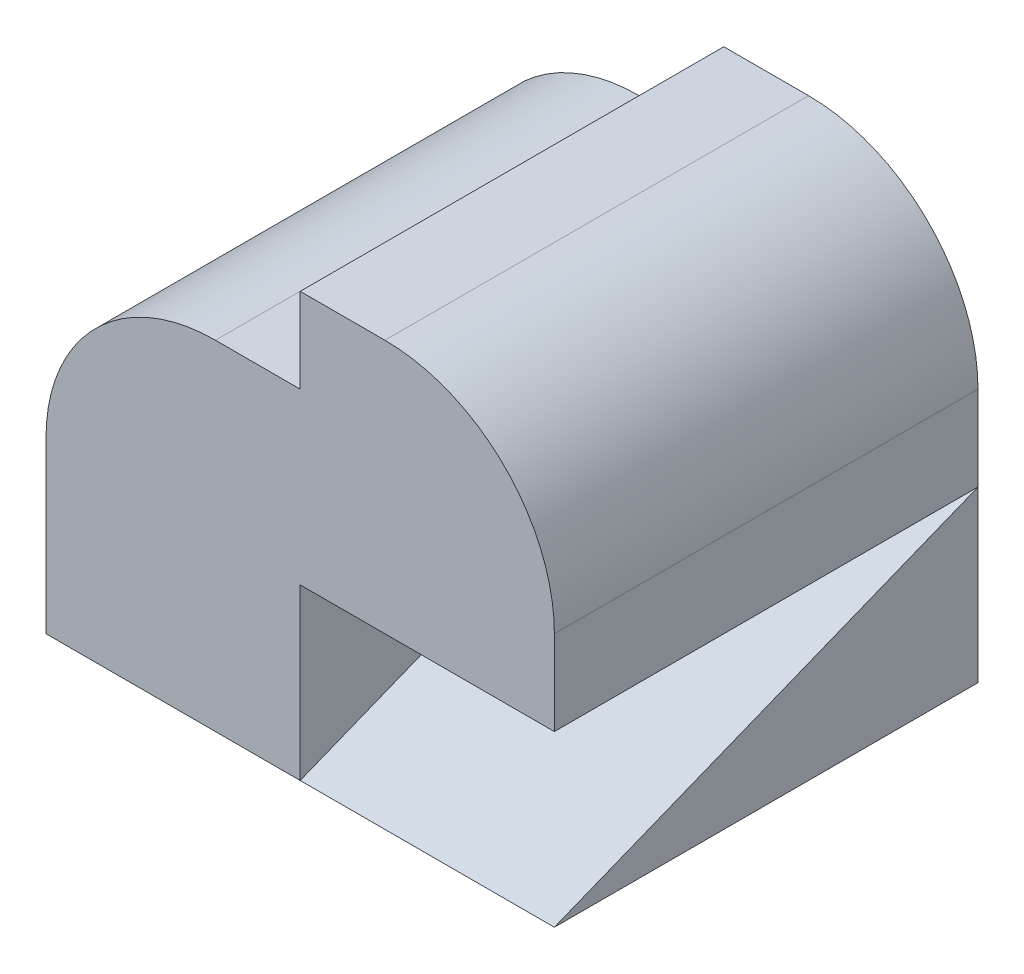
ISO-10303-21;
HEADER;
FILE_DESCRIPTION(('STEP AP214'),'2;1');
FILE_NAME('part.step','',(''),(''),'','','');
FILE_SCHEMA(('AUTOMOTIVE_DESIGN { 1 0 10303 214 1 1 1 1 }'));
ENDSEC;
DATA;
#1=APPLICATION_CONTEXT('core data for automotive mechanical design processes');
#2=APPLICATION_PROTOCOL_DEFINITION('international standard','automotive_design',2000,#1);
#3=PRODUCT_CONTEXT('',#1,'mechanical');
#4=PRODUCT('Part','Part','',(#3));
#5=PRODUCT_RELATED_PRODUCT_CATEGORY('part','',(#4));
#6=PRODUCT_DEFINITION_FORMATION('','',#4);
#7=PRODUCT_DEFINITION_CONTEXT('part definition',#1,'design');
#8=PRODUCT_DEFINITION('design','',#6,#7);
#9=PRODUCT_DEFINITION_SHAPE('','',#8);
#10=(LENGTH_UNIT() NAMED_UNIT(*) SI_UNIT(.MILLI.,.METRE.));
#11=(NAMED_UNIT(*) PLANE_ANGLE_UNIT() SI_UNIT($,.RADIAN.));
#12=(NAMED_UNIT(*) SI_UNIT($,.STERADIAN.) SOLID_ANGLE_UNIT());
#13=UNCERTAINTY_MEASURE_WITH_UNIT(LENGTH_MEASURE(1.E-05),#10,'distance_accuracy_value','');
#14=(GEOMETRIC_REPRESENTATION_CONTEXT(3) GLOBAL_UNCERTAINTY_ASSIGNED_CONTEXT((#13)) GLOBAL_UNIT_ASSIGNED_CONTEXT((#10,
#11,#12)) REPRESENTATION_CONTEXT('',''));
#15=CARTESIAN_POINT('',(0.,0.,0.));
#16=DIRECTION('',(0.,0.,1.));
#17=DIRECTION('',(1.,0.,0.));
#18=AXIS2_PLACEMENT_3D('',#15,#16,#17);
#19=CARTESIAN_POINT('',(15.,0.,0.));
#20=DIRECTION('',(0.,1.,0.));
#21=DIRECTION('',(0.,0.,1.));
#22=AXIS2_PLACEMENT_3D('',#19,#20,#21);
#23=PLANE('',#22);
#24=DIRECTION('',(0.,0.,-1.));
#25=VECTOR('',#24,1.);
#26=CARTESIAN_POINT('',(0.,0.,0.));
#27=LINE('',#26,#25);
#28=CARTESIAN_POINT('',(0.,0.,25.));
#29=VERTEX_POINT('',#28);
#30=CARTESIAN_POINT('',(0.,0.,0.));
#31=VERTEX_POINT('',#30);
#32=EDGE_CURVE('E90',#29,#31,#27,.T.);
#33=ORIENTED_EDGE('',*,*,#32,.T.);
#34=DIRECTION('',(-1.,0.,0.));
#35=VECTOR('',#34,1.);
#36=CARTESIAN_POINT('',(15.,0.,0.));
#37=LINE('',#36,#35);
#38=CARTESIAN_POINT('',(15.,0.,0.));
#39=VERTEX_POINT('',#38);
#40=EDGE_CURVE('E12',#39,#31,#37,.T.);
#41=ORIENTED_EDGE('',*,*,#40,.F.);
#42=DIRECTION('',(0.,0.,-1.));
#43=VECTOR('',#42,1.);
#44=CARTESIAN_POINT('',(15.,0.,0.));
#45=LINE('',#44,#43);
#46=CARTESIAN_POINT('',(15.,0.,25.));
#47=VERTEX_POINT('',#46);
#48=EDGE_CURVE('E83',#47,#39,#45,.T.);
#49=ORIENTED_EDGE('',*,*,#48,.F.);
#50=DIRECTION('',(-1.,0.,0.));
#51=VECTOR('',#50,1.);
#52=CARTESIAN_POINT('',(15.,0.,25.));
#53=LINE('',#52,#51);
#54=EDGE_CURVE('E91',#47,#29,#53,.T.);
#55=ORIENTED_EDGE('',*,*,#54,.T.);
#56=EDGE_LOOP('',(#33,#41,#49,#55));
#57=FACE_BOUND('',#56,.T.);
#58=ADVANCED_FACE('F43',(#57),#23,.F.);
#59=CARTESIAN_POINT('',(15.,10.,0.));
#60=DIRECTION('',(0.,0.,1.));
#61=DIRECTION('',(1.,0.,0.));
#62=AXIS2_PLACEMENT_3D('',#59,#60,#61);
#63=PLANE('',#62);
#64=DIRECTION('',(0.,1.,0.));
#65=VECTOR('',#64,1.);
#66=CARTESIAN_POINT('',(0.,10.,0.));
#67=LINE('',#66,#65);
#68=CARTESIAN_POINT('',(0.,10.,0.));
#69=VERTEX_POINT('',#68);
#70=EDGE_CURVE('E71',#31,#69,#67,.T.);
#71=ORIENTED_EDGE('',*,*,#70,.T.);
#72=DIRECTION('',(-1.,0.,0.));
#73=VECTOR('',#72,1.);
#74=CARTESIAN_POINT('',(15.,10.,0.));
#75=LINE('',#74,#73);
#76=CARTESIAN_POINT('',(15.,10.,0.));
#77=VERTEX_POINT('',#76);
#78=EDGE_CURVE('E51',#77,#69,#75,.T.);
#79=ORIENTED_EDGE('',*,*,#78,.F.);
#80=DIRECTION('',(0.,1.,0.));
#81=VECTOR('',#80,1.);
#82=CARTESIAN_POINT('',(15.,10.,0.));
#83=LINE('',#82,#81);
#84=EDGE_CURVE('E79',#39,#77,#83,.T.);
#85=ORIENTED_EDGE('',*,*,#84,.F.);
#86=ORIENTED_EDGE('',*,*,#40,.T.);
#87=EDGE_LOOP('',(#71,#79,#85,#86));
#88=FACE_BOUND('',#87,.T.);
#89=ADVANCED_FACE('F80',(#88),#63,.F.);
#90=CARTESIAN_POINT('',(15.,0.,25.));
#91=DIRECTION('',(0.,-0.928476690885259,-0.371390676354104));
#92=DIRECTION('',(0.,0.371390676354104,-0.928476690885259));
#93=AXIS2_PLACEMENT_3D('',#90,#91,#92);
#94=PLANE('',#93);
#95=DIRECTION('',(0.,-0.371390676354104,0.928476690885259));
#96=VECTOR('',#95,1.);
#97=CARTESIAN_POINT('',(0.,0.,25.));
#98=LINE('',#97,#96);
#99=EDGE_CURVE('E76',#69,#29,#98,.T.);
#100=ORIENTED_EDGE('',*,*,#99,.T.);
#101=ORIENTED_EDGE('',*,*,#54,.F.);
#102=DIRECTION('',(0.,-0.371390676354104,0.928476690885259));
#103=VECTOR('',#102,1.);
#104=CARTESIAN_POINT('',(15.,0.,25.));
#105=LINE('',#104,#103);
#106=EDGE_CURVE('E59',#77,#47,#105,.T.);
#107=ORIENTED_EDGE('',*,*,#106,.F.);
#108=ORIENTED_EDGE('',*,*,#78,.T.);
#109=EDGE_LOOP('',(#100,#101,#107,#108));
#110=FACE_BOUND('',#109,.T.);
#111=ADVANCED_FACE('F98',(#110),#94,.F.);
#112=CARTESIAN_POINT('',(15.,0.,0.));
#113=DIRECTION('',(1.,0.,0.));
#114=DIRECTION('',(0.,0.,-1.));
#115=AXIS2_PLACEMENT_3D('',#112,#113,#114);
#116=PLANE('',#115);
#117=ORIENTED_EDGE('',*,*,#48,.T.);
#118=ORIENTED_EDGE('',*,*,#84,.T.);
#119=ORIENTED_EDGE('',*,*,#106,.T.);
#120=EDGE_LOOP('',(#117,#118,#119));
#121=FACE_BOUND('',#120,.T.);
#122=ADVANCED_FACE('F86',(#121),#116,.T.);
#123=CARTESIAN_POINT('',(0.,0.,0.));
#124=DIRECTION('',(1.,0.,0.));
#125=DIRECTION('',(0.,0.,-1.));
#126=AXIS2_PLACEMENT_3D('',#123,#124,#125);
#127=PLANE('',#126);
#128=ORIENTED_EDGE('',*,*,#32,.F.);
#129=ORIENTED_EDGE('',*,*,#99,.F.);
#130=ORIENTED_EDGE('',*,*,#70,.F.);
#131=EDGE_LOOP('',(#128,#129,#130));
#132=FACE_BOUND('',#131,.T.);
#133=ADVANCED_FACE('F99',(#132),#127,.F.);
#134=CLOSED_SHELL('',(#58,#89,#111,#122,#133));
#135=MANIFOLD_SOLID_BREP('B2',#134);
#136=CARTESIAN_POINT('',(-15.,0.,25.));
#137=DIRECTION('',(1.,0.,0.));
#138=DIRECTION('',(0.,0.,-1.));
#139=AXIS2_PLACEMENT_3D('',#136,#137,#138);
#140=PLANE('',#139);
#141=DIRECTION('',(0.,-1.,0.));
#142=VECTOR('',#141,1.);
#143=CARTESIAN_POINT('',(-15.,0.,0.));
#144=LINE('',#143,#142);
#145=CARTESIAN_POINT('',(-15.,10.,0.));
#146=VERTEX_POINT('',#145);
#147=CARTESIAN_POINT('',(-15.,0.,0.));
#148=VERTEX_POINT('',#147);
#149=EDGE_CURVE('E296',#146,#148,#144,.T.);
#150=ORIENTED_EDGE('',*,*,#149,.T.);
#151=DIRECTION('',(0.,0.,-1.));
#152=VECTOR('',#151,1.);
#153=CARTESIAN_POINT('',(-15.,0.,25.));
#154=LINE('',#153,#152);
#155=CARTESIAN_POINT('',(-15.,0.,25.));
#156=VERTEX_POINT('',#155);
#157=EDGE_CURVE('E41',#156,#148,#154,.T.);
#158=ORIENTED_EDGE('',*,*,#157,.F.);
#159=DIRECTION('',(0.,-1.,0.));
#160=VECTOR('',#159,1.);
#161=CARTESIAN_POINT('',(-15.,0.,25.));
#162=LINE('',#161,#160);
#163=CARTESIAN_POINT('',(-15.,10.,25.));
#164=VERTEX_POINT('',#163);
#165=EDGE_CURVE('E287',#164,#156,#162,.T.);
#166=ORIENTED_EDGE('',*,*,#165,.F.);
#167=DIRECTION('',(0.,0.,-1.));
#168=VECTOR('',#167,1.);
#169=CARTESIAN_POINT('',(-15.,10.,25.));
#170=LINE('',#169,#168);
#171=EDGE_CURVE('E288',#164,#146,#170,.T.);
#172=ORIENTED_EDGE('',*,*,#171,.T.);
#173=EDGE_LOOP('',(#150,#158,#166,#172));
#174=FACE_BOUND('',#173,.T.);
#175=ADVANCED_FACE('F141',(#174),#140,.F.);
#176=CARTESIAN_POINT('',(-15.,0.,25.));
#177=DIRECTION('',(0.,1.,0.));
#178=DIRECTION('',(-1.,0.,0.));
#179=AXIS2_PLACEMENT_3D('',#176,#177,#178);
#180=PLANE('',#179);
#181=DIRECTION('',(1.,0.,0.));
#182=VECTOR('',#181,1.);
#183=CARTESIAN_POINT('',(-15.,0.,0.));
#184=LINE('',#183,#182);
#185=CARTESIAN_POINT('',(0.,0.,0.));
#186=VERTEX_POINT('',#185);
#187=EDGE_CURVE('E279',#148,#186,#184,.T.);
#188=ORIENTED_EDGE('',*,*,#187,.T.);
#189=DIRECTION('',(0.,0.,-1.));
#190=VECTOR('',#189,1.);
#191=CARTESIAN_POINT('',(0.,0.,25.));
#192=LINE('',#191,#190);
#193=CARTESIAN_POINT('',(0.,0.,25.));
#194=VERTEX_POINT('',#193);
#195=EDGE_CURVE('E149',#194,#186,#192,.T.);
#196=ORIENTED_EDGE('',*,*,#195,.F.);
#197=DIRECTION('',(1.,0.,0.));
#198=VECTOR('',#197,1.);
#199=CARTESIAN_POINT('',(-15.,0.,25.));
#200=LINE('',#199,#198);
#201=EDGE_CURVE('E194',#156,#194,#200,.T.);
#202=ORIENTED_EDGE('',*,*,#201,.F.);
#203=ORIENTED_EDGE('',*,*,#157,.T.);
#204=EDGE_LOOP('',(#188,#196,#202,#203));
#205=FACE_BOUND('',#204,.T.);
#206=ADVANCED_FACE('F330',(#205),#180,.F.);
#207=CARTESIAN_POINT('',(0.,0.,25.));
#208=DIRECTION('',(-1.,0.,0.));
#209=DIRECTION('',(0.,0.,1.));
#210=AXIS2_PLACEMENT_3D('',#207,#208,#209);
#211=PLANE('',#210);
#212=DIRECTION('',(0.,1.,0.));
#213=VECTOR('',#212,1.);
#214=CARTESIAN_POINT('',(0.,0.,0.));
#215=LINE('',#214,#213);
#216=CARTESIAN_POINT('',(0.,10.,0.));
#217=VERTEX_POINT('',#216);
#218=EDGE_CURVE('E276',#186,#217,#215,.T.);
#219=ORIENTED_EDGE('',*,*,#218,.T.);
#220=DIRECTION('',(0.,0.,1.));
#221=VECTOR('',#220,1.);
#222=CARTESIAN_POINT('',(0.,10.,0.));
#223=LINE('',#222,#221);
#224=CARTESIAN_POINT('',(0.,10.,25.));
#225=VERTEX_POINT('',#224);
#226=EDGE_CURVE('E251',#217,#225,#223,.T.);
#227=ORIENTED_EDGE('',*,*,#226,.T.);
#228=DIRECTION('',(0.,1.,0.));
#229=VECTOR('',#228,1.);
#230=CARTESIAN_POINT('',(0.,0.,25.));
#231=LINE('',#230,#229);
#232=EDGE_CURVE('E280',#194,#225,#231,.T.);
#233=ORIENTED_EDGE('',*,*,#232,.F.);
#234=ORIENTED_EDGE('',*,*,#195,.T.);
#235=EDGE_LOOP('',(#219,#227,#233,#234));
#236=FACE_BOUND('',#235,.T.);
#237=ADVANCED_FACE('F331',(#236),#211,.F.);
#238=CARTESIAN_POINT('',(0.,20.,25.));
#239=DIRECTION('',(0.,-1.,0.));
#240=DIRECTION('',(0.,0.,-1.));
#241=AXIS2_PLACEMENT_3D('',#238,#239,#240);
#242=PLANE('',#241);
#243=DIRECTION('',(-1.,0.,0.));
#244=VECTOR('',#243,1.);
#245=CARTESIAN_POINT('',(0.,20.,0.));
#246=LINE('',#245,#244);
#247=CARTESIAN_POINT('',(0.,20.,0.));
#248=VERTEX_POINT('',#247);
#249=CARTESIAN_POINT('',(-5.,20.,0.));
#250=VERTEX_POINT('',#249);
#251=EDGE_CURVE('E268',#248,#250,#246,.T.);
#252=ORIENTED_EDGE('',*,*,#251,.T.);
#253=DIRECTION('',(0.,0.,-1.));
#254=VECTOR('',#253,1.);
#255=CARTESIAN_POINT('',(-5.,20.,25.));
#256=LINE('',#255,#254);
#257=CARTESIAN_POINT('',(-5.,20.,25.));
#258=VERTEX_POINT('',#257);
#259=EDGE_CURVE('E267',#258,#250,#256,.T.);
#260=ORIENTED_EDGE('',*,*,#259,.F.);
#261=DIRECTION('',(-1.,0.,0.));
#262=VECTOR('',#261,1.);
#263=CARTESIAN_POINT('',(0.,20.,25.));
#264=LINE('',#263,#262);
#265=CARTESIAN_POINT('',(0.,20.,25.));
#266=VERTEX_POINT('',#265);
#267=EDGE_CURVE('E292',#266,#258,#264,.T.);
#268=ORIENTED_EDGE('',*,*,#267,.F.);
#269=DIRECTION('',(0.,0.,-1.));
#270=VECTOR('',#269,1.);
#271=CARTESIAN_POINT('',(0.,20.,25.));
#272=LINE('',#271,#270);
#273=EDGE_CURVE('E263',#266,#248,#272,.T.);
#274=ORIENTED_EDGE('',*,*,#273,.T.);
#275=EDGE_LOOP('',(#252,#260,#268,#274));
#276=FACE_BOUND('',#275,.T.);
#277=ADVANCED_FACE('F333',(#276),#242,.F.);
#278=CARTESIAN_POINT('',(-5.,10.,25.));
#279=DIRECTION('',(0.,0.,-1.));
#280=DIRECTION('',(-1.,0.,0.));
#281=AXIS2_PLACEMENT_3D('',#278,#279,#280);
#282=CYLINDRICAL_SURFACE('',#281,9.99999999999999);
#283=CARTESIAN_POINT('',(-5.,10.,0.));
#284=DIRECTION('',(0.,0.,1.));
#285=DIRECTION('',(-1.,0.,0.));
#286=AXIS2_PLACEMENT_3D('',#283,#284,#285);
#287=CIRCLE('',#286,9.99999999999999);
#288=EDGE_CURVE('E187',#250,#146,#287,.T.);
#289=ORIENTED_EDGE('',*,*,#288,.T.);
#290=ORIENTED_EDGE('',*,*,#171,.F.);
#291=CARTESIAN_POINT('',(-5.,10.,25.));
#292=DIRECTION('',(0.,0.,1.));
#293=DIRECTION('',(-1.,0.,0.));
#294=AXIS2_PLACEMENT_3D('',#291,#292,#293);
#295=CIRCLE('',#294,9.99999999999999);
#296=EDGE_CURVE('E166',#258,#164,#295,.T.);
#297=ORIENTED_EDGE('',*,*,#296,.F.);
#298=ORIENTED_EDGE('',*,*,#259,.T.);
#299=EDGE_LOOP('',(#289,#290,#297,#298));
#300=FACE_BOUND('',#299,.T.);
#301=ADVANCED_FACE('F339',(#300),#282,.T.);
#302=CARTESIAN_POINT('',(-5.,10.,25.));
#303=DIRECTION('',(0.,0.,-1.));
#304=DIRECTION('',(-1.,0.,0.));
#305=AXIS2_PLACEMENT_3D('',#302,#303,#304);
#306=PLANE('',#305);
#307=ORIENTED_EDGE('',*,*,#165,.T.);
#308=ORIENTED_EDGE('',*,*,#201,.T.);
#309=ORIENTED_EDGE('',*,*,#232,.T.);
#310=DIRECTION('',(1.,0.,0.));
#311=VECTOR('',#310,1.);
#312=CARTESIAN_POINT('',(0.,10.,25.));
#313=LINE('',#312,#311);
#314=CARTESIAN_POINT('',(15.,10.,25.));
#315=VERTEX_POINT('',#314);
#316=EDGE_CURVE('E157',#225,#315,#313,.T.);
#317=ORIENTED_EDGE('',*,*,#316,.T.);
#318=DIRECTION('',(0.,1.,0.));
#319=VECTOR('',#318,1.);
#320=CARTESIAN_POINT('',(15.,10.,25.));
#321=LINE('',#320,#319);
#322=CARTESIAN_POINT('',(15.,15.,25.));
#323=VERTEX_POINT('',#322);
#324=EDGE_CURVE('E233',#315,#323,#321,.T.);
#325=ORIENTED_EDGE('',*,*,#324,.T.);
#326=CARTESIAN_POINT('',(5.,15.,25.));
#327=DIRECTION('',(0.,0.,1.));
#328=DIRECTION('',(1.,0.,0.));
#329=AXIS2_PLACEMENT_3D('',#326,#327,#328);
#330=CIRCLE('',#329,10.);
#331=CARTESIAN_POINT('',(5.,25.,25.));
#332=VERTEX_POINT('',#331);
#333=EDGE_CURVE('E318',#323,#332,#330,.T.);
#334=ORIENTED_EDGE('',*,*,#333,.T.);
#335=DIRECTION('',(-1.,0.,0.));
#336=VECTOR('',#335,1.);
#337=CARTESIAN_POINT('',(0.,25.,25.));
#338=LINE('',#337,#336);
#339=CARTESIAN_POINT('',(0.,25.,25.));
#340=VERTEX_POINT('',#339);
#341=EDGE_CURVE('E255',#332,#340,#338,.T.);
#342=ORIENTED_EDGE('',*,*,#341,.T.);
#343=DIRECTION('',(0.,-1.,0.));
#344=VECTOR('',#343,1.);
#345=CARTESIAN_POINT('',(0.,10.,25.));
#346=LINE('',#345,#344);
#347=EDGE_CURVE('E252',#340,#266,#346,.T.);
#348=ORIENTED_EDGE('',*,*,#347,.T.);
#349=ORIENTED_EDGE('',*,*,#267,.T.);
#350=ORIENTED_EDGE('',*,*,#296,.T.);
#351=EDGE_LOOP('',(#307,#308,#309,#317,#325,#334,#342,#348,#349,#350));
#352=FACE_BOUND('',#351,.T.);
#353=ADVANCED_FACE('F328',(#352),#306,.F.);
#354=CARTESIAN_POINT('',(-5.,10.,0.));
#355=DIRECTION('',(0.,0.,-1.));
#356=DIRECTION('',(-1.,0.,0.));
#357=AXIS2_PLACEMENT_3D('',#354,#355,#356);
#358=PLANE('',#357);
#359=ORIENTED_EDGE('',*,*,#149,.F.);
#360=ORIENTED_EDGE('',*,*,#288,.F.);
#361=ORIENTED_EDGE('',*,*,#251,.F.);
#362=DIRECTION('',(0.,-1.,0.));
#363=VECTOR('',#362,1.);
#364=CARTESIAN_POINT('',(0.,10.,0.));
#365=LINE('',#364,#363);
#366=CARTESIAN_POINT('',(0.,25.,0.));
#367=VERTEX_POINT('',#366);
#368=EDGE_CURVE('E236',#367,#248,#365,.T.);
#369=ORIENTED_EDGE('',*,*,#368,.F.);
#370=DIRECTION('',(-1.,0.,0.));
#371=VECTOR('',#370,1.);
#372=CARTESIAN_POINT('',(0.,25.,0.));
#373=LINE('',#372,#371);
#374=CARTESIAN_POINT('',(5.,25.,0.));
#375=VERTEX_POINT('',#374);
#376=EDGE_CURVE('E323',#375,#367,#373,.T.);
#377=ORIENTED_EDGE('',*,*,#376,.F.);
#378=CARTESIAN_POINT('',(5.,15.,0.));
#379=DIRECTION('',(0.,0.,1.));
#380=DIRECTION('',(1.,0.,0.));
#381=AXIS2_PLACEMENT_3D('',#378,#379,#380);
#382=CIRCLE('',#381,10.);
#383=CARTESIAN_POINT('',(15.,15.,0.));
#384=VERTEX_POINT('',#383);
#385=EDGE_CURVE('E248',#384,#375,#382,.T.);
#386=ORIENTED_EDGE('',*,*,#385,.F.);
#387=DIRECTION('',(0.,1.,0.));
#388=VECTOR('',#387,1.);
#389=CARTESIAN_POINT('',(15.,10.,0.));
#390=LINE('',#389,#388);
#391=CARTESIAN_POINT('',(15.,10.,0.));
#392=VERTEX_POINT('',#391);
#393=EDGE_CURVE('E231',#392,#384,#390,.T.);
#394=ORIENTED_EDGE('',*,*,#393,.F.);
#395=DIRECTION('',(1.,0.,0.));
#396=VECTOR('',#395,1.);
#397=CARTESIAN_POINT('',(0.,10.,0.));
#398=LINE('',#397,#396);
#399=EDGE_CURVE('E244',#217,#392,#398,.T.);
#400=ORIENTED_EDGE('',*,*,#399,.F.);
#401=ORIENTED_EDGE('',*,*,#218,.F.);
#402=ORIENTED_EDGE('',*,*,#187,.F.);
#403=EDGE_LOOP('',(#359,#360,#361,#369,#377,#386,#394,#400,#401,#402));
#404=FACE_BOUND('',#403,.T.);
#405=ADVANCED_FACE('F242',(#404),#358,.T.);
#406=CARTESIAN_POINT('',(0.,10.,0.));
#407=DIRECTION('',(-1.,0.,0.));
#408=DIRECTION('',(0.,0.,1.));
#409=AXIS2_PLACEMENT_3D('',#406,#407,#408);
#410=PLANE('',#409);
#411=ORIENTED_EDGE('',*,*,#273,.F.);
#412=ORIENTED_EDGE('',*,*,#347,.F.);
#413=DIRECTION('',(0.,0.,1.));
#414=VECTOR('',#413,1.);
#415=CARTESIAN_POINT('',(0.,25.,0.));
#416=LINE('',#415,#414);
#417=EDGE_CURVE('E298',#367,#340,#416,.T.);
#418=ORIENTED_EDGE('',*,*,#417,.F.);
#419=ORIENTED_EDGE('',*,*,#368,.T.);
#420=EDGE_LOOP('',(#411,#412,#418,#419));
#421=FACE_BOUND('',#420,.T.);
#422=ADVANCED_FACE('F386',(#421),#410,.T.);
#423=CARTESIAN_POINT('',(0.,10.,0.));
#424=DIRECTION('',(0.,-1.,0.));
#425=DIRECTION('',(0.,0.,-1.));
#426=AXIS2_PLACEMENT_3D('',#423,#424,#425);
#427=PLANE('',#426);
#428=ORIENTED_EDGE('',*,*,#316,.F.);
#429=ORIENTED_EDGE('',*,*,#226,.F.);
#430=ORIENTED_EDGE('',*,*,#399,.T.);
#431=DIRECTION('',(0.,0.,1.));
#432=VECTOR('',#431,1.);
#433=CARTESIAN_POINT('',(15.,10.,0.));
#434=LINE('',#433,#432);
#435=EDGE_CURVE('E228',#392,#315,#434,.T.);
#436=ORIENTED_EDGE('',*,*,#435,.T.);
#437=EDGE_LOOP('',(#428,#429,#430,#436));
#438=FACE_BOUND('',#437,.T.);
#439=ADVANCED_FACE('F250',(#438),#427,.T.);
#440=CARTESIAN_POINT('',(0.,25.,0.));
#441=DIRECTION('',(0.,1.,0.));
#442=DIRECTION('',(0.,0.,1.));
#443=AXIS2_PLACEMENT_3D('',#440,#441,#442);
#444=PLANE('',#443);
#445=ORIENTED_EDGE('',*,*,#341,.F.);
#446=DIRECTION('',(0.,0.,1.));
#447=VECTOR('',#446,1.);
#448=CARTESIAN_POINT('',(5.,25.,0.));
#449=LINE('',#448,#447);
#450=EDGE_CURVE('E302',#375,#332,#449,.T.);
#451=ORIENTED_EDGE('',*,*,#450,.F.);
#452=ORIENTED_EDGE('',*,*,#376,.T.);
#453=ORIENTED_EDGE('',*,*,#417,.T.);
#454=EDGE_LOOP('',(#445,#451,#452,#453));
#455=FACE_BOUND('',#454,.T.);
#456=ADVANCED_FACE('F404',(#455),#444,.T.);
#457=CARTESIAN_POINT('',(5.,15.,0.));
#458=DIRECTION('',(0.,0.,1.));
#459=DIRECTION('',(1.,0.,0.));
#460=AXIS2_PLACEMENT_3D('',#457,#458,#459);
#461=CYLINDRICAL_SURFACE('',#460,10.);
#462=ORIENTED_EDGE('',*,*,#333,.F.);
#463=DIRECTION('',(0.,0.,1.));
#464=VECTOR('',#463,1.);
#465=CARTESIAN_POINT('',(15.,15.,0.));
#466=LINE('',#465,#464);
#467=EDGE_CURVE('E235',#384,#323,#466,.T.);
#468=ORIENTED_EDGE('',*,*,#467,.F.);
#469=ORIENTED_EDGE('',*,*,#385,.T.);
#470=ORIENTED_EDGE('',*,*,#450,.T.);
#471=EDGE_LOOP('',(#462,#468,#469,#470));
#472=FACE_BOUND('',#471,.T.);
#473=ADVANCED_FACE('F327',(#472),#461,.T.);
#474=CARTESIAN_POINT('',(15.,10.,0.));
#475=DIRECTION('',(1.,0.,0.));
#476=DIRECTION('',(0.,0.,-1.));
#477=AXIS2_PLACEMENT_3D('',#474,#475,#476);
#478=PLANE('',#477);
#479=ORIENTED_EDGE('',*,*,#324,.F.);
#480=ORIENTED_EDGE('',*,*,#435,.F.);
#481=ORIENTED_EDGE('',*,*,#393,.T.);
#482=ORIENTED_EDGE('',*,*,#467,.T.);
#483=EDGE_LOOP('',(#479,#480,#481,#482));
#484=FACE_BOUND('',#483,.T.);
#485=ADVANCED_FACE('F230',(#484),#478,.T.);
#486=CLOSED_SHELL('',(#175,#206,#237,#277,#301,#353,#405,#422,#439,#456,#473,#485));
#487=MANIFOLD_SOLID_BREP('B6',#486);
#488=ADVANCED_BREP_SHAPE_REPRESENTATION('',(#18,#135,#487),#14);
#489=SHAPE_DEFINITION_REPRESENTATION(#9,#488);
ENDSEC;
END-ISO-10303-21;
